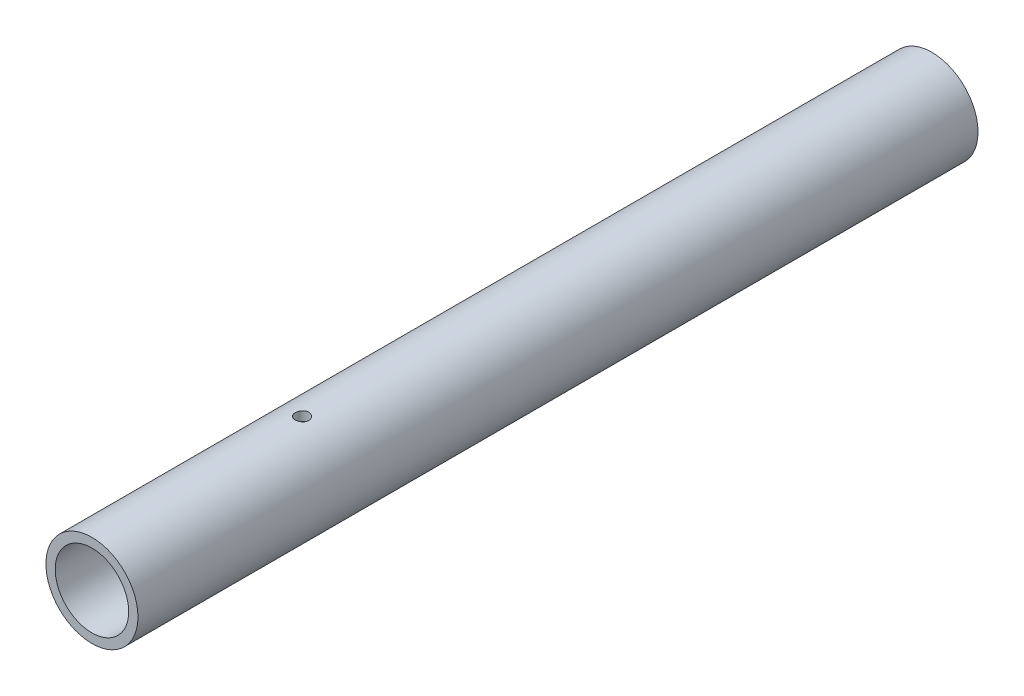
ISO-10303-21;
HEADER;
FILE_DESCRIPTION(('STEP AP214'),'2;1');
FILE_NAME('part.step','',(''),(''),'','','');
FILE_SCHEMA(('AUTOMOTIVE_DESIGN { 1 0 10303 214 1 1 1 1 }'));
ENDSEC;
DATA;
#1=APPLICATION_CONTEXT('core data for automotive mechanical design processes');
#2=APPLICATION_PROTOCOL_DEFINITION('international standard','automotive_design',2000,#1);
#3=PRODUCT_CONTEXT('',#1,'mechanical');
#4=PRODUCT('Part','Part','',(#3));
#5=PRODUCT_RELATED_PRODUCT_CATEGORY('part','',(#4));
#6=PRODUCT_DEFINITION_FORMATION('','',#4);
#7=PRODUCT_DEFINITION_CONTEXT('part definition',#1,'design');
#8=PRODUCT_DEFINITION('design','',#6,#7);
#9=PRODUCT_DEFINITION_SHAPE('','',#8);
#10=(LENGTH_UNIT() NAMED_UNIT(*) SI_UNIT(.MILLI.,.METRE.));
#11=(NAMED_UNIT(*) PLANE_ANGLE_UNIT() SI_UNIT($,.RADIAN.));
#12=(NAMED_UNIT(*) SI_UNIT($,.STERADIAN.) SOLID_ANGLE_UNIT());
#13=UNCERTAINTY_MEASURE_WITH_UNIT(LENGTH_MEASURE(1.E-05),#10,'distance_accuracy_value','');
#14=(GEOMETRIC_REPRESENTATION_CONTEXT(3) GLOBAL_UNCERTAINTY_ASSIGNED_CONTEXT((#13)) GLOBAL_UNIT_ASSIGNED_CONTEXT((#10,
#11,#12)) REPRESENTATION_CONTEXT('',''));
#15=CARTESIAN_POINT('',(0.,0.,0.));
#16=DIRECTION('',(0.,0.,1.));
#17=DIRECTION('',(1.,0.,0.));
#18=AXIS2_PLACEMENT_3D('',#15,#16,#17);
#19=CARTESIAN_POINT('',(-21.082,21.082,-304.8));
#20=DIRECTION('',(0.,0.,1.));
#21=DIRECTION('',(1.,0.,0.));
#22=AXIS2_PLACEMENT_3D('',#19,#20,#21);
#23=CYLINDRICAL_SURFACE('',#22,13.335);
#24=CARTESIAN_POINT('',(-21.082,21.082,-304.8));
#25=DIRECTION('',(0.,0.,1.));
#26=DIRECTION('',(1.,0.,0.));
#27=AXIS2_PLACEMENT_3D('',#24,#25,#26);
#28=CIRCLE('',#27,13.335);
#29=CARTESIAN_POINT('',(-7.747,21.082,-304.8));
#30=VERTEX_POINT('',#29);
#31=EDGE_CURVE('E26',#30,#30,#28,.T.);
#32=ORIENTED_EDGE('',*,*,#31,.F.);
#33=EDGE_LOOP('',(#32));
#34=FACE_BOUND('',#33,.T.);
#35=CARTESIAN_POINT('',(-21.082,21.082,0.));
#36=DIRECTION('',(0.,0.,1.));
#37=DIRECTION('',(1.,0.,0.));
#38=AXIS2_PLACEMENT_3D('',#35,#36,#37);
#39=CIRCLE('',#38,13.335);
#40=CARTESIAN_POINT('',(-7.747,21.082,0.));
#41=VERTEX_POINT('',#40);
#42=EDGE_CURVE('E38',#41,#41,#39,.T.);
#43=ORIENTED_EDGE('',*,*,#42,.T.);
#44=EDGE_LOOP('',(#43));
#45=FACE_BOUND('',#44,.T.);
#46=CARTESIAN_POINT('',(-21.082,7.747,-78.65745));
#47=CARTESIAN_POINT('',(-21.2187948592161,7.74700246138851,-78.6574447279434));
#48=CARTESIAN_POINT('',(-21.3556588089519,7.74912669516432,-78.6459892993906));
#49=CARTESIAN_POINT('',(-21.6255328892023,7.75739597096117,-78.6004980658493));
#50=CARTESIAN_POINT('',(-21.7585396182342,7.7635444555255,-78.5664429276031));
#51=CARTESIAN_POINT('',(-22.0167570063155,7.77917414800193,-78.4768280336677));
#52=CARTESIAN_POINT('',(-22.1419744849863,7.78865239090288,-78.4212874054762));
#53=CARTESIAN_POINT('',(-22.381301289392,7.80990543665334,-78.2903317601848));
#54=CARTESIAN_POINT('',(-22.4954115725284,7.82168004130124,-78.2149184581211));
#55=CARTESIAN_POINT('',(-22.7106192126991,7.84637781056411,-78.0454303196822));
#56=CARTESIAN_POINT('',(-22.8115692501581,7.8593116256834,-77.951169956784));
#57=CARTESIAN_POINT('',(-22.9963166393543,7.88479065235194,-77.7470625447916));
#58=CARTESIAN_POINT('',(-23.0801127842092,7.89733583650594,-77.6372143999206));
#59=CARTESIAN_POINT('',(-23.2287828884571,7.92072063313501,-77.4040131424123));
#60=CARTESIAN_POINT('',(-23.2935076576815,7.93154650780949,-77.2805634196347));
#61=CARTESIAN_POINT('',(-23.4012428236667,7.95011721664654,-77.0243098271869));
#62=CARTESIAN_POINT('',(-23.4442550265487,7.95786230706729,-76.8915067366076));
#63=CARTESIAN_POINT('',(-23.5068726758867,7.96928749596631,-76.6218902281098));
#64=CARTESIAN_POINT('',(-23.5267346384497,7.97301210848251,-76.4851383087179));
#65=CARTESIAN_POINT('',(-23.5432840700824,7.97610890094767,-76.2101961493011));
#66=CARTESIAN_POINT('',(-23.539973545933,7.97548145779287,-76.0720060348617));
#67=CARTESIAN_POINT('',(-23.5104801303221,7.96998557897495,-75.799964179379));
#68=CARTESIAN_POINT('',(-23.4845883521836,7.96517112371681,-75.6660796260605));
#69=CARTESIAN_POINT('',(-23.4111256016635,7.95192842897875,-75.4045878086399));
#70=CARTESIAN_POINT('',(-23.3635537365083,7.94350004067998,-75.2769808032834));
#71=CARTESIAN_POINT('',(-23.2477948262212,7.9239224125834,-75.0308114131764));
#72=CARTESIAN_POINT('',(-23.1794896961569,7.91275766005443,-74.9123058414145));
#73=CARTESIAN_POINT('',(-23.0242867525056,7.88897562685651,-74.6883284705087));
#74=CARTESIAN_POINT('',(-22.9373871140764,7.8763582036804,-74.5828579522129));
#75=CARTESIAN_POINT('',(-22.7458896784635,7.85085696289075,-74.3862621178351));
#76=CARTESIAN_POINT('',(-22.6410427550772,7.83797201270355,-74.2953794399826));
#77=CARTESIAN_POINT('',(-22.41746202952,7.81356408713008,-74.1324569100719));
#78=CARTESIAN_POINT('',(-22.2987280969616,7.8020411245338,-74.0604172349544));
#79=CARTESIAN_POINT('',(-22.0504947125879,7.78163342130704,-73.9371921300755));
#80=CARTESIAN_POINT('',(-21.920982766617,7.77275179868147,-73.8860313207487));
#81=CARTESIAN_POINT('',(-21.6550032946867,7.75865171938389,-73.8062582619009));
#82=CARTESIAN_POINT('',(-21.5185364836401,7.75343288701331,-73.7776436997364));
#83=CARTESIAN_POINT('',(-21.2446091877513,7.74729783901729,-73.7441117004924));
#84=CARTESIAN_POINT('',(-21.1071907192645,7.74632124742975,-73.7388617100524));
#85=CARTESIAN_POINT('',(-20.8334392593011,7.74861416766826,-73.7513167205142));
#86=CARTESIAN_POINT('',(-20.6971062166863,7.7518834782499,-73.7690206334622));
#87=CARTESIAN_POINT('',(-20.4304459559282,7.76226330061286,-73.8266043891773));
#88=CARTESIAN_POINT('',(-20.300081297479,7.76934475525787,-73.8663165461128));
#89=CARTESIAN_POINT('',(-20.0478602705809,7.78655813545782,-73.9666084838202));
#90=CARTESIAN_POINT('',(-19.9260044650044,7.79669026258393,-74.0271896435356));
#91=CARTESIAN_POINT('',(-19.6928368291016,7.81903165684358,-74.1682400760522));
#92=CARTESIAN_POINT('',(-19.5816504065329,7.83126179610768,-74.248913284951));
#93=CARTESIAN_POINT('',(-19.3742741582703,7.85638739771225,-74.4275811070687));
#94=CARTESIAN_POINT('',(-19.2780856835404,7.86928291984906,-74.5255772789865));
#95=CARTESIAN_POINT('',(-19.1021770879758,7.89448536944479,-74.737612622083));
#96=CARTESIAN_POINT('',(-19.0226835622907,7.90678264811425,-74.8518411170566));
#97=CARTESIAN_POINT('',(-18.884012814721,7.9292044022091,-75.0922256851818));
#98=CARTESIAN_POINT('',(-18.8248348539643,7.93932895665093,-75.2183813243332));
#99=CARTESIAN_POINT('',(-18.7287992161255,7.95618372699651,-75.4784544261316));
#100=CARTESIAN_POINT('',(-18.6918362442675,7.96292992983026,-75.6123319229694));
#101=CARTESIAN_POINT('',(-18.6409539378688,7.97230128953629,-75.8845325906455));
#102=CARTESIAN_POINT('',(-18.6270321017495,7.97492689378079,-76.0228552772066));
#103=CARTESIAN_POINT('',(-18.6227087345663,7.97573762670359,-76.2977513116025));
#104=CARTESIAN_POINT('',(-18.6319499077541,7.97399021106364,-76.4343189696051));
#105=CARTESIAN_POINT('',(-18.6729095536375,7.96640108859698,-76.7039189568548));
#106=CARTESIAN_POINT('',(-18.7046279027573,7.96055940427989,-76.8369513055343));
#107=CARTESIAN_POINT('',(-18.7894929713541,7.94546792055123,-77.095520882158));
#108=CARTESIAN_POINT('',(-18.8426022740794,7.93622407457414,-77.2210707603868));
#109=CARTESIAN_POINT('',(-18.9687030161139,7.91536537861531,-77.4615353759613));
#110=CARTESIAN_POINT('',(-19.0416957937877,7.90375036904277,-77.5764493967054));
#111=CARTESIAN_POINT('',(-19.2067390170938,7.87924794172376,-77.7941726100185));
#112=CARTESIAN_POINT('',(-19.2990499657535,7.86634454298404,-77.8967825650116));
#113=CARTESIAN_POINT('',(-19.499564819598,7.8408400336235,-78.0851756099915));
#114=CARTESIAN_POINT('',(-19.6077723720986,7.8282389931497,-78.1709548277576));
#115=CARTESIAN_POINT('',(-19.8381294068908,7.80463131293529,-78.3239426741416));
#116=CARTESIAN_POINT('',(-19.9603914244533,7.79363941269866,-78.3909841925568));
#117=CARTESIAN_POINT('',(-20.214604995074,7.77463226704775,-78.503468701982));
#118=CARTESIAN_POINT('',(-20.3465472195322,7.76661419979943,-78.5489321796519));
#119=CARTESIAN_POINT('',(-20.5794153798655,7.75611158584496,-78.6076351974588));
#120=CARTESIAN_POINT('',(-20.6789717553882,7.75271386847402,-78.6262841532356));
#121=CARTESIAN_POINT('',(-20.8796728460892,7.74815719207529,-78.6511933558369));
#122=CARTESIAN_POINT('',(-20.9808175231439,7.74699817939514,-78.6574538995599));
#123=CARTESIAN_POINT('',(-21.082,7.747,-78.65745));
#124=B_SPLINE_CURVE_WITH_KNOTS('',3,(#46,#47,#48,#49,#50,#51,#52,#53,#54,#55,#56,#57,#58,#59,
#60,#61,#62,#63,#64,#65,#66,#67,#68,#69,#70,#71,#72,#73,#74,#75,#76,#77,#78,#79,#80,#81,#82,#83,
#84,#85,#86,#87,#88,#89,#90,#91,#92,#93,#94,#95,#96,#97,#98,#99,#100,#101,#102,#103,#104,#105,
#106,#107,#108,#109,#110,#111,#112,#113,#114,#115,#116,#117,#118,#119,#120,#121,#122,#123),
.UNSPECIFIED.,.T.,.F.,(4,2,2,2,2,2,2,2,2,2,2,2,2,2,2,2,2,2,2,2,2,2,2,2,2,2,2,2,2,2,2,2,2,2,2,2,
2,2,4),(0.,0.41001457648515,0.820380358967035,1.23038165017484,1.64034756934889,
2.05456761964887,2.46881680287779,2.88622538554577,3.30359924109911,3.71630304912735,
4.12897111667219,4.53639649668784,4.94383865576287,5.35364635958971,5.76349429990501,
6.17957714159766,6.59566389027622,7.01223988202078,7.42877313861734,7.83935841955203,
8.24992424055249,8.6574040394724,9.06491076825971,9.47673551313093,9.88859733236826,
10.3057318683608,10.7228512316648,11.1379776091757,11.5530589134135,11.9617769992006,
12.370492837942,12.7784968402029,13.1865283121663,13.6004645260412,14.0144958621751,
14.432109733558,14.8493263161944,15.1526073380272,15.4558810913949),.UNSPECIFIED.);
#125=CARTESIAN_POINT('',(-21.082,7.747,-78.65745));
#126=VERTEX_POINT('',#125);
#127=EDGE_CURVE('E64',#126,#126,#124,.T.);
#128=ORIENTED_EDGE('',*,*,#127,.F.);
#129=EDGE_LOOP('',(#128));
#130=FACE_BOUND('',#129,.T.);
#131=CARTESIAN_POINT('',(-21.082,34.417,-78.65745));
#132=CARTESIAN_POINT('',(-20.9452051407839,34.4169975386115,-78.6574447279434));
#133=CARTESIAN_POINT('',(-20.8083411910481,34.4148733048357,-78.6459892993906));
#134=CARTESIAN_POINT('',(-20.5384671107977,34.4066040290388,-78.6004980658493));
#135=CARTESIAN_POINT('',(-20.4054603817658,34.4004555444745,-78.5664429276031));
#136=CARTESIAN_POINT('',(-20.1472429936845,34.3848258519981,-78.4768280336677));
#137=CARTESIAN_POINT('',(-20.0220255150137,34.3753476090971,-78.4212874054762));
#138=CARTESIAN_POINT('',(-19.782698710608,34.3540945633466,-78.2903317601848));
#139=CARTESIAN_POINT('',(-19.6685884274716,34.3423199586987,-78.2149184581211));
#140=CARTESIAN_POINT('',(-19.4533807873009,34.3176221894359,-78.0454303196822));
#141=CARTESIAN_POINT('',(-19.3524307498419,34.3046883743166,-77.951169956784));
#142=CARTESIAN_POINT('',(-19.1676833606457,34.2792093476481,-77.7470625447916));
#143=CARTESIAN_POINT('',(-19.0838872157908,34.2666641634941,-77.6372143999206));
#144=CARTESIAN_POINT('',(-18.9352171115429,34.243279366865,-77.4040131424123));
#145=CARTESIAN_POINT('',(-18.8704923423185,34.2324534921905,-77.2805634196347));
#146=CARTESIAN_POINT('',(-18.7627571763333,34.2138827833535,-77.0243098271869));
#147=CARTESIAN_POINT('',(-18.7197449734513,34.2061376929327,-76.8915067366076));
#148=CARTESIAN_POINT('',(-18.6571273241133,34.1947125040337,-76.6218902281098));
#149=CARTESIAN_POINT('',(-18.6372653615503,34.1909878915175,-76.4851383087179));
#150=CARTESIAN_POINT('',(-18.6207159299176,34.1878910990523,-76.2101961493011));
#151=CARTESIAN_POINT('',(-18.624026454067,34.1885185422071,-76.0720060348617));
#152=CARTESIAN_POINT('',(-18.6535198696779,34.1940144210251,-75.799964179379));
#153=CARTESIAN_POINT('',(-18.6794116478164,34.1988288762832,-75.6660796260605));
#154=CARTESIAN_POINT('',(-18.7528743983365,34.2120715710213,-75.4045878086399));
#155=CARTESIAN_POINT('',(-18.8004462634917,34.22049995932,-75.2769808032834));
#156=CARTESIAN_POINT('',(-18.9162051737788,34.2400775874166,-75.0308114131764));
#157=CARTESIAN_POINT('',(-18.9845103038431,34.2512423399456,-74.9123058414145));
#158=CARTESIAN_POINT('',(-19.1397132474944,34.2750243731435,-74.6883284705087));
#159=CARTESIAN_POINT('',(-19.2266128859236,34.2876417963196,-74.5828579522129));
#160=CARTESIAN_POINT('',(-19.4181103215365,34.3131430371093,-74.3862621178351));
#161=CARTESIAN_POINT('',(-19.5229572449228,34.3260279872964,-74.2953794399826));
#162=CARTESIAN_POINT('',(-19.74653797048,34.3504359128699,-74.1324569100719));
#163=CARTESIAN_POINT('',(-19.8652719030384,34.3619588754662,-74.0604172349544));
#164=CARTESIAN_POINT('',(-20.1135052874121,34.382366578693,-73.9371921300755));
#165=CARTESIAN_POINT('',(-20.243017233383,34.3912482013185,-73.8860313207487));
#166=CARTESIAN_POINT('',(-20.5089967053133,34.4053482806161,-73.8062582619009));
#167=CARTESIAN_POINT('',(-20.6454635163599,34.4105671129867,-73.7776436997364));
#168=CARTESIAN_POINT('',(-20.9193908122487,34.4167021609827,-73.7441117004924));
#169=CARTESIAN_POINT('',(-21.0568092807355,34.4176787525702,-73.7388617100524));
#170=CARTESIAN_POINT('',(-21.3305607406989,34.4153858323317,-73.7513167205142));
#171=CARTESIAN_POINT('',(-21.4668937833137,34.4121165217501,-73.7690206334622));
#172=CARTESIAN_POINT('',(-21.7335540440718,34.4017366993871,-73.8266043891773));
#173=CARTESIAN_POINT('',(-21.863918702521,34.3946552447421,-73.8663165461128));
#174=CARTESIAN_POINT('',(-22.1161397294191,34.3774418645422,-73.9666084838202));
#175=CARTESIAN_POINT('',(-22.2379955349956,34.3673097374161,-74.0271896435356));
#176=CARTESIAN_POINT('',(-22.4711631708984,34.3449683431564,-74.1682400760522));
#177=CARTESIAN_POINT('',(-22.5823495934671,34.3327382038923,-74.248913284951));
#178=CARTESIAN_POINT('',(-22.7897258417297,34.3076126022877,-74.4275811070687));
#179=CARTESIAN_POINT('',(-22.8859143164596,34.2947170801509,-74.5255772789865));
#180=CARTESIAN_POINT('',(-23.0618229120242,34.2695146305552,-74.737612622083));
#181=CARTESIAN_POINT('',(-23.1413164377093,34.2572173518858,-74.8518411170566));
#182=CARTESIAN_POINT('',(-23.279987185279,34.2347955977909,-75.0922256851818));
#183=CARTESIAN_POINT('',(-23.3391651460357,34.2246710433491,-75.2183813243332));
#184=CARTESIAN_POINT('',(-23.4352007838745,34.2078162730035,-75.4784544261316));
#185=CARTESIAN_POINT('',(-23.4721637557325,34.2010700701697,-75.6123319229694));
#186=CARTESIAN_POINT('',(-23.5230460621312,34.1916987104637,-75.8845325906455));
#187=CARTESIAN_POINT('',(-23.5369678982505,34.1890731062192,-76.0228552772066));
#188=CARTESIAN_POINT('',(-23.5412912654338,34.1882623732964,-76.2977513116025));
#189=CARTESIAN_POINT('',(-23.5320500922459,34.1900097889364,-76.4343189696051));
#190=CARTESIAN_POINT('',(-23.4910904463625,34.197598911403,-76.7039189568548));
#191=CARTESIAN_POINT('',(-23.4593720972427,34.2034405957201,-76.8369513055343));
#192=CARTESIAN_POINT('',(-23.3745070286459,34.2185320794488,-77.095520882158));
#193=CARTESIAN_POINT('',(-23.3213977259206,34.2277759254259,-77.2210707603868));
#194=CARTESIAN_POINT('',(-23.1952969838861,34.2486346213847,-77.4615353759613));
#195=CARTESIAN_POINT('',(-23.1223042062123,34.2602496309572,-77.5764493967054));
#196=CARTESIAN_POINT('',(-22.9572609829062,34.2847520582762,-77.7941726100185));
#197=CARTESIAN_POINT('',(-22.8649500342465,34.297655457016,-77.8967825650116));
#198=CARTESIAN_POINT('',(-22.664435180402,34.3231599663765,-78.0851756099915));
#199=CARTESIAN_POINT('',(-22.5562276279014,34.3357610068503,-78.1709548277576));
#200=CARTESIAN_POINT('',(-22.3258705931092,34.3593686870647,-78.3239426741416));
#201=CARTESIAN_POINT('',(-22.2036085755467,34.3703605873013,-78.3909841925568));
#202=CARTESIAN_POINT('',(-21.949395004926,34.3893677329523,-78.503468701982));
#203=CARTESIAN_POINT('',(-21.8174527804678,34.3973858002006,-78.5489321796519));
#204=CARTESIAN_POINT('',(-21.5845846201345,34.4078884141551,-78.6076351974588));
#205=CARTESIAN_POINT('',(-21.4850282446118,34.411286131526,-78.6262841532356));
#206=CARTESIAN_POINT('',(-21.2843271539108,34.4158428079247,-78.6511933558369));
#207=CARTESIAN_POINT('',(-21.1831824768561,34.4170018206049,-78.6574538995599));
#208=CARTESIAN_POINT('',(-21.082,34.417,-78.65745));
#209=B_SPLINE_CURVE_WITH_KNOTS('',3,(#131,#132,#133,#134,#135,#136,#137,#138,#139,#140,#141,
#142,#143,#144,#145,#146,#147,#148,#149,#150,#151,#152,#153,#154,#155,#156,#157,#158,#159,#160,
#161,#162,#163,#164,#165,#166,#167,#168,#169,#170,#171,#172,#173,#174,#175,#176,#177,#178,#179,
#180,#181,#182,#183,#184,#185,#186,#187,#188,#189,#190,#191,#192,#193,#194,#195,#196,#197,#198,
#199,#200,#201,#202,#203,#204,#205,#206,#207,#208),.UNSPECIFIED.,.T.,.F.,(4,2,2,2,2,2,2,2,2,2,2,
2,2,2,2,2,2,2,2,2,2,2,2,2,2,2,2,2,2,2,2,2,2,2,2,2,2,2,4),(0.,0.41001457648515,0.820380358967036,
1.23038165017484,1.64034756934889,2.05456761964887,2.46881680287779,2.8862253855458,
3.30359924109911,3.71630304912735,4.12897111667219,4.53639649668785,4.94383865576287,
5.35364635958971,5.76349429990501,6.17957714159766,6.59566389027623,7.01223988202077,
7.42877313861734,7.83935841955204,8.24992424055249,8.6574040394724,9.06491076825971,
9.47673551313093,9.88859733236826,10.3057318683608,10.7228512316648,11.1379776091757,
11.5530589134135,11.9617769992006,12.370492837942,12.7784968402029,13.1865283121663,
13.6004645260412,14.0144958621751,14.432109733558,14.8493263161944,15.1526073380272,
15.4558810913949),.UNSPECIFIED.);
#210=CARTESIAN_POINT('',(-21.082,34.417,-78.65745));
#211=VERTEX_POINT('',#210);
#212=EDGE_CURVE('E42',#211,#211,#209,.T.);
#213=ORIENTED_EDGE('',*,*,#212,.F.);
#214=EDGE_LOOP('',(#213));
#215=FACE_BOUND('',#214,.T.);
#216=ADVANCED_FACE('F14',(#34,#45,#130,#215),#23,.F.);
#217=CARTESIAN_POINT('',(-21.082,21.082,-304.8));
#218=DIRECTION('',(0.,0.,1.));
#219=DIRECTION('',(1.,0.,0.));
#220=AXIS2_PLACEMENT_3D('',#217,#218,#219);
#221=CYLINDRICAL_SURFACE('',#220,16.7005);
#222=CARTESIAN_POINT('',(-21.082,4.38149999999993,-78.65745));
#223=CARTESIAN_POINT('',(-21.2192410025861,4.38150217022764,-78.6574443172633));
#224=CARTESIAN_POINT('',(-21.3565623956143,4.38320947043393,-78.6459144631919));
#225=CARTESIAN_POINT('',(-21.6273689540258,4.38985592631601,-78.6001101597742));
#226=CARTESIAN_POINT('',(-21.7608502162954,4.39479825679205,-78.5658133668969));
#227=CARTESIAN_POINT('',(-22.0200180396953,4.40735919749008,-78.4755203931146));
#228=CARTESIAN_POINT('',(-22.1457103326025,4.41497581156103,-78.4195403938812));
#229=CARTESIAN_POINT('',(-22.385897404253,4.43204301368479,-78.287509131431));
#230=CARTESIAN_POINT('',(-22.5003937795525,4.44149333967203,-78.2114607357377));
#231=CARTESIAN_POINT('',(-22.7158207402294,4.46125610797714,-78.0408410916021));
#232=CARTESIAN_POINT('',(-22.8166548187989,4.47157392543233,-77.9461486019759));
#233=CARTESIAN_POINT('',(-23.0010624074876,4.49186656951296,-77.7411895979179));
#234=CARTESIAN_POINT('',(-23.0846349394977,4.50184137667537,-77.6309222015447));
#235=CARTESIAN_POINT('',(-23.2325209157727,4.52037083566303,-77.3972975113157));
#236=CARTESIAN_POINT('',(-23.2967413324265,4.52891854227709,-77.2738807317752));
#237=CARTESIAN_POINT('',(-23.4035056494003,4.54355286891186,-77.0178659029884));
#238=CARTESIAN_POINT('',(-23.4460506862938,4.54963961797227,-76.8852683355614));
#239=CARTESIAN_POINT('',(-23.5079575758216,4.55861017493004,-76.6156693841489));
#240=CARTESIAN_POINT('',(-23.5274843989345,4.56151676395097,-76.4787066534293));
#241=CARTESIAN_POINT('',(-23.5433115579708,4.5638671257459,-76.2034199981308));
#242=CARTESIAN_POINT('',(-23.5396131779794,4.563311089963,-76.0650961492283));
#243=CARTESIAN_POINT('',(-23.5092298042709,4.55881986212579,-75.7921771947428));
#244=CARTESIAN_POINT('',(-23.4827282970978,4.55491164436883,-75.6575611543372));
#245=CARTESIAN_POINT('',(-23.4077780629622,4.54419853790695,-75.3947075525631));
#246=CARTESIAN_POINT('',(-23.3593287365733,4.53739357008794,-75.2664701655109));
#247=CARTESIAN_POINT('',(-23.2416665440084,4.52162381709451,-75.019454347405));
#248=CARTESIAN_POINT('',(-23.1723757110282,4.51265094717217,-74.9007135919144));
#249=CARTESIAN_POINT('',(-23.015052973247,4.49356229566387,-74.6764751085356));
#250=CARTESIAN_POINT('',(-22.9270198840983,4.48344644187025,-74.5709782182144));
#251=CARTESIAN_POINT('',(-22.7337031901897,4.46309234898183,-74.3751585159882));
#252=CARTESIAN_POINT('',(-22.6282617795468,4.45285386871947,-74.2849914450624));
#253=CARTESIAN_POINT('',(-22.4036600538203,4.43349859776556,-74.1236095060202));
#254=CARTESIAN_POINT('',(-22.2844996826839,4.42438181165731,-74.0523947153427));
#255=CARTESIAN_POINT('',(-22.0357093989535,4.40828813116989,-73.9309318294017));
#256=CARTESIAN_POINT('',(-21.9060736736605,4.40131243531078,-73.8806954716035));
#257=CARTESIAN_POINT('',(-21.6400804191064,4.39029701398562,-73.8027494217297));
#258=CARTESIAN_POINT('',(-21.5037233276105,4.38625709758012,-73.7750382646292));
#259=CARTESIAN_POINT('',(-21.2295024730446,4.38159365374626,-73.743135682363));
#260=CARTESIAN_POINT('',(-21.0916641349996,4.38093901885359,-73.7387300929091));
#261=CARTESIAN_POINT('',(-20.8172166541374,4.38303530468459,-73.7529956484227));
#262=CARTESIAN_POINT('',(-20.6806074748632,4.38578612406444,-73.7716661066641));
#263=CARTESIAN_POINT('',(-20.4131427905492,4.39436498495105,-73.8313757006782));
#264=CARTESIAN_POINT('',(-20.2822635546725,4.40017870626027,-73.8723107697769));
#265=CARTESIAN_POINT('',(-20.0292261655705,4.41423349016355,-73.9752780368446));
#266=CARTESIAN_POINT('',(-19.9070684087839,4.42247466301131,-74.0373111930986));
#267=CARTESIAN_POINT('',(-19.6739980364468,4.44054552893848,-74.1812181108909));
#268=CARTESIAN_POINT('',(-19.5631703540769,4.45038596415434,-74.2632280559232));
#269=CARTESIAN_POINT('',(-19.356774875305,4.47052588724284,-74.4445706148625));
#270=CARTESIAN_POINT('',(-19.2612079312108,4.4808254007138,-74.5439041956418));
#271=CARTESIAN_POINT('',(-19.0872698274103,4.50082097799922,-74.7580265331705));
#272=CARTESIAN_POINT('',(-19.0090420400417,4.51051156777357,-74.8729323442112));
#273=CARTESIAN_POINT('',(-18.872998662043,4.52809597281138,-75.1143789935112));
#274=CARTESIAN_POINT('',(-18.8151825363919,4.5359898351679,-75.240919526697));
#275=CARTESIAN_POINT('',(-18.7218271060897,4.54904764859629,-75.501611777507));
#276=CARTESIAN_POINT('',(-18.6862116934773,4.55422091670073,-75.6357357532424));
#277=CARTESIAN_POINT('',(-18.6380260685937,4.561276809771,-75.9081430575069));
#278=CARTESIAN_POINT('',(-18.6254543299195,4.56315965269279,-76.0464261099238));
#279=CARTESIAN_POINT('',(-18.6237482142702,4.56341358601077,-76.3217975487836));
#280=CARTESIAN_POINT('',(-18.6343884363395,4.5618184495872,-76.4588845609534));
#281=CARTESIAN_POINT('',(-18.6783218848314,4.55536945775816,-76.7292971833747));
#282=CARTESIAN_POINT('',(-18.71161508032,4.55051560680268,-76.8626227987623));
#283=CARTESIAN_POINT('',(-18.7998308017396,4.53810773318024,-77.1216695342128));
#284=CARTESIAN_POINT('',(-18.8547381671704,4.53055560346834,-77.2473959133437));
#285=CARTESIAN_POINT('',(-18.9846012513694,4.51359971271564,-77.4878884088105));
#286=CARTESIAN_POINT('',(-19.059557597283,4.5041958937552,-77.602654182139));
#287=CARTESIAN_POINT('',(-19.2282120463707,4.4844873863608,-77.8191138162986));
#288=CARTESIAN_POINT('',(-19.3220772439782,4.47417516335743,-77.9206768138982));
#289=CARTESIAN_POINT('',(-19.5255319399101,4.45387512936404,-78.1066905461732));
#290=CARTESIAN_POINT('',(-19.6351250934428,4.44388739444926,-78.1911372919613));
#291=CARTESIAN_POINT('',(-19.8676048077276,4.42530155759623,-78.3409183780189));
#292=CARTESIAN_POINT('',(-19.9905585822699,4.41671108120421,-78.4061493188647));
#293=CARTESIAN_POINT('',(-20.2457440746554,4.40196264813273,-78.5149373896911));
#294=CARTESIAN_POINT('',(-20.3779659599812,4.39580215814263,-78.5585171038905));
#295=CARTESIAN_POINT('',(-20.6059938609505,4.3880238199316,-78.6128114887158));
#296=CARTESIAN_POINT('',(-20.7003882944617,4.38558987156475,-78.629525538698));
#297=CARTESIAN_POINT('',(-20.8905087814731,4.3823272138367,-78.6518467118515));
#298=CARTESIAN_POINT('',(-20.9862348193353,4.38149848564019,-78.6574539653478));
#299=CARTESIAN_POINT('',(-21.082,4.38149999999993,-78.65745));
#300=B_SPLINE_CURVE_WITH_KNOTS('',3,(#222,#223,#224,#225,#226,#227,#228,#229,#230,#231,#232,
#233,#234,#235,#236,#237,#238,#239,#240,#241,#242,#243,#244,#245,#246,#247,#248,#249,#250,#251,
#252,#253,#254,#255,#256,#257,#258,#259,#260,#261,#262,#263,#264,#265,#266,#267,#268,#269,#270,
#271,#272,#273,#274,#275,#276,#277,#278,#279,#280,#281,#282,#283,#284,#285,#286,#287,#288,#289,
#290,#291,#292,#293,#294,#295,#296,#297,#298,#299),.UNSPECIFIED.,.T.,.F.,(4,2,2,2,2,2,2,2,2,2,2,
2,2,2,2,2,2,2,2,2,2,2,2,2,2,2,2,2,2,2,2,2,2,2,2,2,2,2,4),(0.,0.411373088645835,0.82315049792333,
1.2346211975503,1.64603313495375,2.06021450565259,2.47441933911035,2.89058464983195,
3.30672813619849,3.71987064933668,4.13299032067574,4.54281656225306,4.9526539974467,
5.36404409199506,5.77546019053723,6.19083418843245,6.60620988351658,7.02181767156507,
7.43739842658156,7.84915352273241,8.26089636564909,8.67073102247499,9.0805842966683,
9.49331386503612,9.90606647617901,10.3221142694046,10.7381511565683,11.1527538368046,
11.5673290529477,11.9778964485713,12.3884632835396,12.7987426524889,13.2090348567502,
13.6231257305417,14.0373129961949,14.4536898970231,14.8696315618026,15.1566863025583,
15.4437376750522),.UNSPECIFIED.);
#301=CARTESIAN_POINT('',(-21.082,4.38149999999993,-78.65745));
#302=VERTEX_POINT('',#301);
#303=EDGE_CURVE('E45',#302,#302,#300,.T.);
#304=ORIENTED_EDGE('',*,*,#303,.T.);
#305=EDGE_LOOP('',(#304));
#306=FACE_BOUND('',#305,.T.);
#307=CARTESIAN_POINT('',(-21.082,21.082,-304.8));
#308=DIRECTION('',(0.,0.,1.));
#309=DIRECTION('',(1.,0.,0.));
#310=AXIS2_PLACEMENT_3D('',#307,#308,#309);
#311=CIRCLE('',#310,16.7005);
#312=CARTESIAN_POINT('',(-4.3815,21.082,-304.8));
#313=VERTEX_POINT('',#312);
#314=EDGE_CURVE('E10',#313,#313,#311,.T.);
#315=ORIENTED_EDGE('',*,*,#314,.T.);
#316=EDGE_LOOP('',(#315));
#317=FACE_BOUND('',#316,.T.);
#318=CARTESIAN_POINT('',(-21.082,21.082,0.));
#319=DIRECTION('',(0.,0.,1.));
#320=DIRECTION('',(1.,0.,0.));
#321=AXIS2_PLACEMENT_3D('',#318,#319,#320);
#322=CIRCLE('',#321,16.7005);
#323=CARTESIAN_POINT('',(-4.3815,21.082,0.));
#324=VERTEX_POINT('',#323);
#325=EDGE_CURVE('E34',#324,#324,#322,.T.);
#326=ORIENTED_EDGE('',*,*,#325,.F.);
#327=EDGE_LOOP('',(#326));
#328=FACE_BOUND('',#327,.T.);
#329=CARTESIAN_POINT('',(-21.082,37.7825,-78.65745));
#330=CARTESIAN_POINT('',(-20.9447589974139,37.7824978297723,-78.6574443172633));
#331=CARTESIAN_POINT('',(-20.8074376043857,37.780790529566,-78.6459144631919));
#332=CARTESIAN_POINT('',(-20.5366310459742,37.774144073684,-78.6001101597742));
#333=CARTESIAN_POINT('',(-20.4031497837046,37.769201743208,-78.5658133668969));
#334=CARTESIAN_POINT('',(-20.1439819603047,37.7566408025099,-78.4755203931146));
#335=CARTESIAN_POINT('',(-20.0182896673975,37.749024188439,-78.4195403938812));
#336=CARTESIAN_POINT('',(-19.778102595747,37.7319569863152,-78.287509131431));
#337=CARTESIAN_POINT('',(-19.6636062204475,37.722506660328,-78.2114607357377));
#338=CARTESIAN_POINT('',(-19.4481792597706,37.7027438920229,-78.0408410916021));
#339=CARTESIAN_POINT('',(-19.3473451812011,37.6924260745677,-77.9461486019759));
#340=CARTESIAN_POINT('',(-19.1629375925124,37.672133430487,-77.7411895979179));
#341=CARTESIAN_POINT('',(-19.0793650605023,37.6621586233246,-77.6309222015447));
#342=CARTESIAN_POINT('',(-18.9314790842273,37.643629164337,-77.3972975113157));
#343=CARTESIAN_POINT('',(-18.8672586675735,37.6350814577229,-77.2738807317753));
#344=CARTESIAN_POINT('',(-18.7604943505997,37.6204471310881,-77.0178659029884));
#345=CARTESIAN_POINT('',(-18.7179493137063,37.6143603820277,-76.8852683355614));
#346=CARTESIAN_POINT('',(-18.6560424241784,37.60538982507,-76.6156693841489));
#347=CARTESIAN_POINT('',(-18.6365156010656,37.602483236049,-76.4787066534293));
#348=CARTESIAN_POINT('',(-18.6206884420291,37.6001328742541,-76.2034199981308));
#349=CARTESIAN_POINT('',(-18.6243868220206,37.600688910037,-76.0650961492283));
#350=CARTESIAN_POINT('',(-18.6547701957291,37.6051801378742,-75.7921771947427));
#351=CARTESIAN_POINT('',(-18.6812717029022,37.6090883556312,-75.6575611543372));
#352=CARTESIAN_POINT('',(-18.7562219370378,37.6198014620931,-75.394707552563));
#353=CARTESIAN_POINT('',(-18.8046712634267,37.6266064299121,-75.2664701655108));
#354=CARTESIAN_POINT('',(-18.9223334559916,37.6423761829055,-75.0194543474049));
#355=CARTESIAN_POINT('',(-18.9916242889718,37.6513490528278,-74.9007135919143));
#356=CARTESIAN_POINT('',(-19.1489470267531,37.6704377043361,-74.6764751085355));
#357=CARTESIAN_POINT('',(-19.2369801159017,37.6805535581298,-74.5709782182144));
#358=CARTESIAN_POINT('',(-19.4302968098103,37.7009076510182,-74.3751585159882));
#359=CARTESIAN_POINT('',(-19.5357382204532,37.7111461312805,-74.2849914450624));
#360=CARTESIAN_POINT('',(-19.7603399461797,37.7305014022344,-74.1236095060202));
#361=CARTESIAN_POINT('',(-19.8795003173161,37.7396181883427,-74.0523947153427));
#362=CARTESIAN_POINT('',(-20.1282906010465,37.7557118688301,-73.9309318294017));
#363=CARTESIAN_POINT('',(-20.2579263263395,37.7626875646892,-73.8806954716035));
#364=CARTESIAN_POINT('',(-20.5239195808936,37.7737029860144,-73.8027494217297));
#365=CARTESIAN_POINT('',(-20.6602766723895,37.7777429024199,-73.7750382646292));
#366=CARTESIAN_POINT('',(-20.9344975269554,37.7824063462537,-73.743135682363));
#367=CARTESIAN_POINT('',(-21.0723358650004,37.7830609811464,-73.7387300929091));
#368=CARTESIAN_POINT('',(-21.3467833458626,37.7809646953154,-73.7529956484227));
#369=CARTESIAN_POINT('',(-21.4833925251368,37.7782138759356,-73.7716661066641));
#370=CARTESIAN_POINT('',(-21.7508572094508,37.769635015049,-73.8313757006782));
#371=CARTESIAN_POINT('',(-21.8817364453275,37.7638212937397,-73.8723107697769));
#372=CARTESIAN_POINT('',(-22.1347738344295,37.7497665098365,-73.9752780368446));
#373=CARTESIAN_POINT('',(-22.2569315912161,37.7415253369887,-74.0373111930986));
#374=CARTESIAN_POINT('',(-22.4900019635532,37.7234544710616,-74.1812181108909));
#375=CARTESIAN_POINT('',(-22.600829645923,37.7136140358457,-74.2632280559232));
#376=CARTESIAN_POINT('',(-22.807225124695,37.6934741127572,-74.4445706148625));
#377=CARTESIAN_POINT('',(-22.9027920687892,37.6831745992862,-74.5439041956418));
#378=CARTESIAN_POINT('',(-23.0767301725897,37.6631790220008,-74.7580265331705));
#379=CARTESIAN_POINT('',(-23.1549579599583,37.6534884322264,-74.8729323442112));
#380=CARTESIAN_POINT('',(-23.291001337957,37.6359040271886,-75.1143789935112));
#381=CARTESIAN_POINT('',(-23.3488174636081,37.6280101648321,-75.240919526697));
#382=CARTESIAN_POINT('',(-23.4421728939103,37.6149523514037,-75.501611777507));
#383=CARTESIAN_POINT('',(-23.4777883065227,37.6097790832993,-75.6357357532424));
#384=CARTESIAN_POINT('',(-23.5259739314063,37.602723190229,-75.9081430575069));
#385=CARTESIAN_POINT('',(-23.5385456700805,37.6008403473072,-76.0464261099238));
#386=CARTESIAN_POINT('',(-23.5402517857298,37.6005864139892,-76.3217975487836));
#387=CARTESIAN_POINT('',(-23.5296115636605,37.6021815504128,-76.4588845609534));
#388=CARTESIAN_POINT('',(-23.4856781151686,37.6086305422418,-76.7292971833747));
#389=CARTESIAN_POINT('',(-23.45238491968,37.6134843931973,-76.8626227987623));
#390=CARTESIAN_POINT('',(-23.3641691982604,37.6258922668198,-77.1216695342128));
#391=CARTESIAN_POINT('',(-23.3092618328296,37.6334443965317,-77.2473959133437));
#392=CARTESIAN_POINT('',(-23.1793987486306,37.6504002872843,-77.4878884088105));
#393=CARTESIAN_POINT('',(-23.104442402717,37.6598041062448,-77.602654182139));
#394=CARTESIAN_POINT('',(-22.9357879536293,37.6795126136392,-77.8191138162986));
#395=CARTESIAN_POINT('',(-22.8419227560218,37.6898248366426,-77.9206768138982));
#396=CARTESIAN_POINT('',(-22.6384680600899,37.710124870636,-78.1066905461732));
#397=CARTESIAN_POINT('',(-22.5288749065572,37.7201126055507,-78.1911372919613));
#398=CARTESIAN_POINT('',(-22.2963951922724,37.7386984424038,-78.3409183780189));
#399=CARTESIAN_POINT('',(-22.1734414177301,37.7472889187958,-78.4061493188647));
#400=CARTESIAN_POINT('',(-21.9182559253446,37.7620373518673,-78.5149373896911));
#401=CARTESIAN_POINT('',(-21.7860340400188,37.7681978418573,-78.5585171038905));
#402=CARTESIAN_POINT('',(-21.5580061390495,37.7759761800684,-78.6128114887158));
#403=CARTESIAN_POINT('',(-21.4636117055383,37.7784101284353,-78.629525538698));
#404=CARTESIAN_POINT('',(-21.2734912185269,37.7816727861633,-78.6518467118515));
#405=CARTESIAN_POINT('',(-21.1777651806647,37.7825015143597,-78.6574539653478));
#406=CARTESIAN_POINT('',(-21.082,37.7825,-78.65745));
#407=B_SPLINE_CURVE_WITH_KNOTS('',3,(#329,#330,#331,#332,#333,#334,#335,#336,#337,#338,#339,
#340,#341,#342,#343,#344,#345,#346,#347,#348,#349,#350,#351,#352,#353,#354,#355,#356,#357,#358,
#359,#360,#361,#362,#363,#364,#365,#366,#367,#368,#369,#370,#371,#372,#373,#374,#375,#376,#377,
#378,#379,#380,#381,#382,#383,#384,#385,#386,#387,#388,#389,#390,#391,#392,#393,#394,#395,#396,
#397,#398,#399,#400,#401,#402,#403,#404,#405,#406),.UNSPECIFIED.,.T.,.F.,(4,2,2,2,2,2,2,2,2,2,2,
2,2,2,2,2,2,2,2,2,2,2,2,2,2,2,2,2,2,2,2,2,2,2,2,2,2,2,4),(0.,0.411373088645834,
0.823150497923326,1.2346211975503,1.64603313495375,2.06021450565259,2.47441933911035,
2.89058464983192,3.30672813619847,3.71987064933667,4.13299032067573,4.54281656225308,
4.95265399744679,5.36404409199509,5.77546019053723,6.19083418843245,6.60620988351658,
7.02181767156508,7.43739842658161,7.84915352273245,8.26089636564908,8.67073102247499,
9.08058429666829,9.49331386503611,9.90606647617901,10.3221142694046,10.7381511565683,
11.1527538368046,11.5673290529477,11.9778964485713,12.3884632835396,12.7987426524889,
13.2090348567502,13.6231257305417,14.0373129961949,14.4536898970231,14.8696315618026,
15.1566863025583,15.4437376750522),.UNSPECIFIED.);
#408=CARTESIAN_POINT('',(-21.082,37.7825,-78.65745));
#409=VERTEX_POINT('',#408);
#410=EDGE_CURVE('E18',#409,#409,#407,.T.);
#411=ORIENTED_EDGE('',*,*,#410,.T.);
#412=EDGE_LOOP('',(#411));
#413=FACE_BOUND('',#412,.T.);
#414=ADVANCED_FACE('F50',(#306,#317,#328,#413),#221,.T.);
#415=CARTESIAN_POINT('',(-21.082,21.082,-304.8));
#416=DIRECTION('',(0.,0.,1.));
#417=DIRECTION('',(1.,0.,0.));
#418=AXIS2_PLACEMENT_3D('',#415,#416,#417);
#419=PLANE('',#418);
#420=ORIENTED_EDGE('',*,*,#31,.T.);
#421=EDGE_LOOP('',(#420));
#422=FACE_BOUND('',#421,.T.);
#423=ORIENTED_EDGE('',*,*,#314,.F.);
#424=EDGE_LOOP('',(#423));
#425=FACE_BOUND('',#424,.T.);
#426=ADVANCED_FACE('F59',(#422,#425),#419,.F.);
#427=CARTESIAN_POINT('',(-21.082,21.082,0.));
#428=DIRECTION('',(0.,0.,1.));
#429=DIRECTION('',(1.,0.,0.));
#430=AXIS2_PLACEMENT_3D('',#427,#428,#429);
#431=PLANE('',#430);
#432=ORIENTED_EDGE('',*,*,#42,.F.);
#433=EDGE_LOOP('',(#432));
#434=FACE_BOUND('',#433,.T.);
#435=ORIENTED_EDGE('',*,*,#325,.T.);
#436=EDGE_LOOP('',(#435));
#437=FACE_BOUND('',#436,.T.);
#438=ADVANCED_FACE('F92',(#434,#437),#431,.T.);
#439=CARTESIAN_POINT('',(-21.082,311.31621471874,-76.2));
#440=DIRECTION('',(0.,-1.,0.));
#441=DIRECTION('',(0.,0.,-1.));
#442=AXIS2_PLACEMENT_3D('',#439,#440,#441);
#443=CYLINDRICAL_SURFACE('',#442,2.45745);
#444=ORIENTED_EDGE('',*,*,#303,.F.);
#445=EDGE_LOOP('',(#444));
#446=FACE_BOUND('',#445,.T.);
#447=ORIENTED_EDGE('',*,*,#127,.T.);
#448=EDGE_LOOP('',(#447));
#449=FACE_BOUND('',#448,.T.);
#450=ADVANCED_FACE('F57',(#446,#449),#443,.F.);
#451=ORIENTED_EDGE('',*,*,#410,.F.);
#452=EDGE_LOOP('',(#451));
#453=FACE_BOUND('',#452,.T.);
#454=ORIENTED_EDGE('',*,*,#212,.T.);
#455=EDGE_LOOP('',(#454));
#456=FACE_BOUND('',#455,.T.);
#457=ADVANCED_FACE('F53',(#453,#456),#443,.F.);
#458=CLOSED_SHELL('',(#216,#414,#426,#438,#450,#457));
#459=MANIFOLD_SOLID_BREP('B1',#458);
#460=ADVANCED_BREP_SHAPE_REPRESENTATION('',(#18,#459),#14);
#461=SHAPE_DEFINITION_REPRESENTATION(#9,#460);
ENDSEC;
END-ISO-10303-21;
